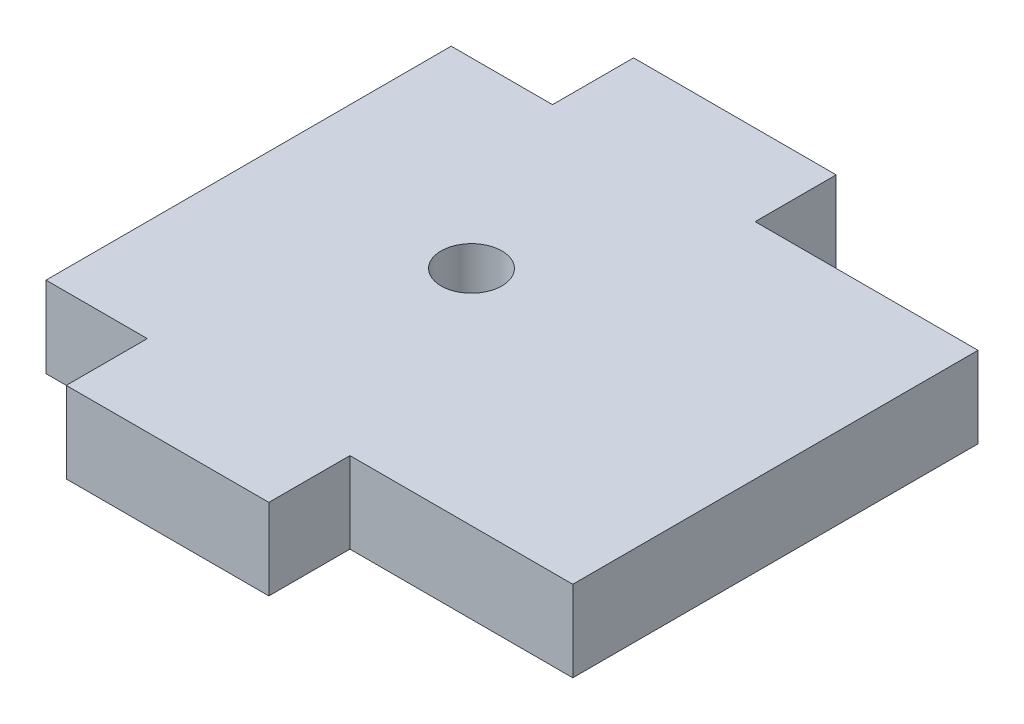
ISO-10303-21;
HEADER;
FILE_DESCRIPTION(('STEP AP214'),'2;1');
FILE_NAME('part.step','',(''),(''),'','','');
FILE_SCHEMA(('AUTOMOTIVE_DESIGN { 1 0 10303 214 1 1 1 1 }'));
ENDSEC;
DATA;
#1=APPLICATION_CONTEXT('core data for automotive mechanical design processes');
#2=APPLICATION_PROTOCOL_DEFINITION('international standard','automotive_design',2000,#1);
#3=PRODUCT_CONTEXT('',#1,'mechanical');
#4=PRODUCT('Part','Part','',(#3));
#5=PRODUCT_RELATED_PRODUCT_CATEGORY('part','',(#4));
#6=PRODUCT_DEFINITION_FORMATION('','',#4);
#7=PRODUCT_DEFINITION_CONTEXT('part definition',#1,'design');
#8=PRODUCT_DEFINITION('design','',#6,#7);
#9=PRODUCT_DEFINITION_SHAPE('','',#8);
#10=(LENGTH_UNIT() NAMED_UNIT(*) SI_UNIT(.MILLI.,.METRE.));
#11=(NAMED_UNIT(*) PLANE_ANGLE_UNIT() SI_UNIT($,.RADIAN.));
#12=(NAMED_UNIT(*) SI_UNIT($,.STERADIAN.) SOLID_ANGLE_UNIT());
#13=UNCERTAINTY_MEASURE_WITH_UNIT(LENGTH_MEASURE(1.E-05),#10,'distance_accuracy_value','');
#14=(GEOMETRIC_REPRESENTATION_CONTEXT(3) GLOBAL_UNCERTAINTY_ASSIGNED_CONTEXT((#13)) GLOBAL_UNIT_ASSIGNED_CONTEXT((#10,
#11,#12)) REPRESENTATION_CONTEXT('',''));
#15=CARTESIAN_POINT('',(0.,0.,0.));
#16=DIRECTION('',(0.,0.,1.));
#17=DIRECTION('',(1.,0.,0.));
#18=AXIS2_PLACEMENT_3D('',#15,#16,#17);
#19=CARTESIAN_POINT('',(0.,4.,0.));
#20=DIRECTION('',(0.,-1.,0.));
#21=DIRECTION('',(0.,0.,-1.));
#22=AXIS2_PLACEMENT_3D('',#19,#20,#21);
#23=PLANE('',#22);
#24=DIRECTION('',(0.,0.,1.));
#25=VECTOR('',#24,1.);
#26=CARTESIAN_POINT('',(0.,4.,0.));
#27=LINE('',#26,#25);
#28=CARTESIAN_POINT('',(0.,4.,-20.));
#29=VERTEX_POINT('',#28);
#30=CARTESIAN_POINT('',(0.,4.,0.));
#31=VERTEX_POINT('',#30);
#32=EDGE_CURVE('E206',#29,#31,#27,.T.);
#33=ORIENTED_EDGE('',*,*,#32,.T.);
#34=DIRECTION('',(1.,0.,0.));
#35=VECTOR('',#34,1.);
#36=CARTESIAN_POINT('',(0.,4.,0.));
#37=LINE('',#36,#35);
#38=CARTESIAN_POINT('',(5.,4.,0.));
#39=VERTEX_POINT('',#38);
#40=EDGE_CURVE('E118',#31,#39,#37,.T.);
#41=ORIENTED_EDGE('',*,*,#40,.T.);
#42=DIRECTION('',(0.,0.,1.));
#43=VECTOR('',#42,1.);
#44=CARTESIAN_POINT('',(5.,4.,0.));
#45=LINE('',#44,#43);
#46=CARTESIAN_POINT('',(5.,4.,4.));
#47=VERTEX_POINT('',#46);
#48=EDGE_CURVE('E243',#39,#47,#45,.T.);
#49=ORIENTED_EDGE('',*,*,#48,.T.);
#50=DIRECTION('',(1.,0.,0.));
#51=VECTOR('',#50,1.);
#52=CARTESIAN_POINT('',(5.,4.,4.));
#53=LINE('',#52,#51);
#54=CARTESIAN_POINT('',(15.,4.,4.));
#55=VERTEX_POINT('',#54);
#56=EDGE_CURVE('E263',#47,#55,#53,.T.);
#57=ORIENTED_EDGE('',*,*,#56,.T.);
#58=DIRECTION('',(0.,0.,-1.));
#59=VECTOR('',#58,1.);
#60=CARTESIAN_POINT('',(15.,4.,0.));
#61=LINE('',#60,#59);
#62=CARTESIAN_POINT('',(15.,4.,0.));
#63=VERTEX_POINT('',#62);
#64=EDGE_CURVE('E259',#55,#63,#61,.T.);
#65=ORIENTED_EDGE('',*,*,#64,.T.);
#66=DIRECTION('',(1.,0.,0.));
#67=VECTOR('',#66,1.);
#68=CARTESIAN_POINT('',(15.,4.,0.));
#69=LINE('',#68,#67);
#70=CARTESIAN_POINT('',(26.,4.,0.));
#71=VERTEX_POINT('',#70);
#72=EDGE_CURVE('E262',#63,#71,#69,.T.);
#73=ORIENTED_EDGE('',*,*,#72,.T.);
#74=DIRECTION('',(0.,0.,-1.));
#75=VECTOR('',#74,1.);
#76=CARTESIAN_POINT('',(26.,4.,0.));
#77=LINE('',#76,#75);
#78=CARTESIAN_POINT('',(26.,4.,-20.));
#79=VERTEX_POINT('',#78);
#80=EDGE_CURVE('E267',#71,#79,#77,.T.);
#81=ORIENTED_EDGE('',*,*,#80,.T.);
#82=DIRECTION('',(-1.,0.,0.));
#83=VECTOR('',#82,1.);
#84=CARTESIAN_POINT('',(15.,4.,-20.));
#85=LINE('',#84,#83);
#86=CARTESIAN_POINT('',(15.,4.,-20.));
#87=VERTEX_POINT('',#86);
#88=EDGE_CURVE('E274',#79,#87,#85,.T.);
#89=ORIENTED_EDGE('',*,*,#88,.T.);
#90=DIRECTION('',(0.,0.,-1.));
#91=VECTOR('',#90,1.);
#92=CARTESIAN_POINT('',(15.,4.,-20.));
#93=LINE('',#92,#91);
#94=CARTESIAN_POINT('',(15.,4.,-24.));
#95=VERTEX_POINT('',#94);
#96=EDGE_CURVE('E149',#87,#95,#93,.T.);
#97=ORIENTED_EDGE('',*,*,#96,.T.);
#98=DIRECTION('',(-1.,0.,0.));
#99=VECTOR('',#98,1.);
#100=CARTESIAN_POINT('',(5.,4.,-24.));
#101=LINE('',#100,#99);
#102=CARTESIAN_POINT('',(5.,4.,-24.));
#103=VERTEX_POINT('',#102);
#104=EDGE_CURVE('E143',#95,#103,#101,.T.);
#105=ORIENTED_EDGE('',*,*,#104,.T.);
#106=DIRECTION('',(0.,0.,1.));
#107=VECTOR('',#106,1.);
#108=CARTESIAN_POINT('',(5.,4.,-20.));
#109=LINE('',#108,#107);
#110=CARTESIAN_POINT('',(5.,4.,-20.));
#111=VERTEX_POINT('',#110);
#112=EDGE_CURVE('E147',#103,#111,#109,.T.);
#113=ORIENTED_EDGE('',*,*,#112,.T.);
#114=DIRECTION('',(-1.,0.,0.));
#115=VECTOR('',#114,1.);
#116=CARTESIAN_POINT('',(0.,4.,-20.));
#117=LINE('',#116,#115);
#118=EDGE_CURVE('E63',#111,#29,#117,.T.);
#119=ORIENTED_EDGE('',*,*,#118,.T.);
#120=EDGE_LOOP('',(#33,#41,#49,#57,#65,#73,#81,#89,#97,#105,#113,#119));
#121=FACE_BOUND('',#120,.T.);
#122=CARTESIAN_POINT('',(10.,4.,-11.));
#123=DIRECTION('',(0.,1.,0.));
#124=DIRECTION('',(0.,0.,1.));
#125=AXIS2_PLACEMENT_3D('',#122,#123,#124);
#126=CIRCLE('',#125,1.5);
#127=CARTESIAN_POINT('',(10.,4.,-9.5));
#128=VERTEX_POINT('',#127);
#129=EDGE_CURVE('E176',#128,#128,#126,.T.);
#130=ORIENTED_EDGE('',*,*,#129,.F.);
#131=EDGE_LOOP('',(#130));
#132=FACE_BOUND('',#131,.T.);
#133=ADVANCED_FACE('F45',(#121,#132),#23,.F.);
#134=CARTESIAN_POINT('',(0.,0.,0.));
#135=DIRECTION('',(0.,-1.,0.));
#136=DIRECTION('',(0.,0.,-1.));
#137=AXIS2_PLACEMENT_3D('',#134,#135,#136);
#138=PLANE('',#137);
#139=DIRECTION('',(0.,0.,1.));
#140=VECTOR('',#139,1.);
#141=CARTESIAN_POINT('',(0.,0.,0.));
#142=LINE('',#141,#140);
#143=CARTESIAN_POINT('',(0.,0.,-20.));
#144=VERTEX_POINT('',#143);
#145=CARTESIAN_POINT('',(0.,0.,0.));
#146=VERTEX_POINT('',#145);
#147=EDGE_CURVE('E171',#144,#146,#142,.T.);
#148=ORIENTED_EDGE('',*,*,#147,.F.);
#149=DIRECTION('',(-1.,0.,0.));
#150=VECTOR('',#149,1.);
#151=CARTESIAN_POINT('',(0.,0.,-20.));
#152=LINE('',#151,#150);
#153=CARTESIAN_POINT('',(5.,0.,-20.));
#154=VERTEX_POINT('',#153);
#155=EDGE_CURVE('E110',#154,#144,#152,.T.);
#156=ORIENTED_EDGE('',*,*,#155,.F.);
#157=DIRECTION('',(0.,0.,1.));
#158=VECTOR('',#157,1.);
#159=CARTESIAN_POINT('',(5.,0.,-20.));
#160=LINE('',#159,#158);
#161=CARTESIAN_POINT('',(5.,0.,-24.));
#162=VERTEX_POINT('',#161);
#163=EDGE_CURVE('E104',#162,#154,#160,.T.);
#164=ORIENTED_EDGE('',*,*,#163,.F.);
#165=DIRECTION('',(-1.,0.,0.));
#166=VECTOR('',#165,1.);
#167=CARTESIAN_POINT('',(5.,0.,-24.));
#168=LINE('',#167,#166);
#169=CARTESIAN_POINT('',(15.,0.,-24.));
#170=VERTEX_POINT('',#169);
#171=EDGE_CURVE('E158',#170,#162,#168,.T.);
#172=ORIENTED_EDGE('',*,*,#171,.F.);
#173=DIRECTION('',(0.,0.,-1.));
#174=VECTOR('',#173,1.);
#175=CARTESIAN_POINT('',(15.,0.,-20.));
#176=LINE('',#175,#174);
#177=CARTESIAN_POINT('',(15.,0.,-20.));
#178=VERTEX_POINT('',#177);
#179=EDGE_CURVE('E197',#178,#170,#176,.T.);
#180=ORIENTED_EDGE('',*,*,#179,.F.);
#181=DIRECTION('',(-1.,0.,0.));
#182=VECTOR('',#181,1.);
#183=CARTESIAN_POINT('',(15.,0.,-20.));
#184=LINE('',#183,#182);
#185=CARTESIAN_POINT('',(26.,0.,-20.));
#186=VERTEX_POINT('',#185);
#187=EDGE_CURVE('E194',#186,#178,#184,.T.);
#188=ORIENTED_EDGE('',*,*,#187,.F.);
#189=DIRECTION('',(0.,0.,-1.));
#190=VECTOR('',#189,1.);
#191=CARTESIAN_POINT('',(26.,0.,0.));
#192=LINE('',#191,#190);
#193=CARTESIAN_POINT('',(26.,0.,0.));
#194=VERTEX_POINT('',#193);
#195=EDGE_CURVE('E191',#194,#186,#192,.T.);
#196=ORIENTED_EDGE('',*,*,#195,.F.);
#197=DIRECTION('',(1.,0.,0.));
#198=VECTOR('',#197,1.);
#199=CARTESIAN_POINT('',(15.,0.,0.));
#200=LINE('',#199,#198);
#201=CARTESIAN_POINT('',(15.,0.,0.));
#202=VERTEX_POINT('',#201);
#203=EDGE_CURVE('E188',#202,#194,#200,.T.);
#204=ORIENTED_EDGE('',*,*,#203,.F.);
#205=DIRECTION('',(0.,0.,-1.));
#206=VECTOR('',#205,1.);
#207=CARTESIAN_POINT('',(15.,0.,0.));
#208=LINE('',#207,#206);
#209=CARTESIAN_POINT('',(15.,0.,4.));
#210=VERTEX_POINT('',#209);
#211=EDGE_CURVE('E185',#210,#202,#208,.T.);
#212=ORIENTED_EDGE('',*,*,#211,.F.);
#213=DIRECTION('',(1.,0.,0.));
#214=VECTOR('',#213,1.);
#215=CARTESIAN_POINT('',(5.,0.,4.));
#216=LINE('',#215,#214);
#217=CARTESIAN_POINT('',(5.,0.,4.));
#218=VERTEX_POINT('',#217);
#219=EDGE_CURVE('E182',#218,#210,#216,.T.);
#220=ORIENTED_EDGE('',*,*,#219,.F.);
#221=DIRECTION('',(0.,0.,1.));
#222=VECTOR('',#221,1.);
#223=CARTESIAN_POINT('',(5.,0.,0.));
#224=LINE('',#223,#222);
#225=CARTESIAN_POINT('',(5.,0.,0.));
#226=VERTEX_POINT('',#225);
#227=EDGE_CURVE('E179',#226,#218,#224,.T.);
#228=ORIENTED_EDGE('',*,*,#227,.F.);
#229=DIRECTION('',(1.,0.,0.));
#230=VECTOR('',#229,1.);
#231=CARTESIAN_POINT('',(0.,0.,0.));
#232=LINE('',#231,#230);
#233=EDGE_CURVE('E175',#146,#226,#232,.T.);
#234=ORIENTED_EDGE('',*,*,#233,.F.);
#235=EDGE_LOOP('',(#148,#156,#164,#172,#180,#188,#196,#204,#212,#220,#228,#234));
#236=FACE_BOUND('',#235,.T.);
#237=CARTESIAN_POINT('',(10.,0.,-11.));
#238=DIRECTION('',(0.,1.,0.));
#239=DIRECTION('',(0.,0.,1.));
#240=AXIS2_PLACEMENT_3D('',#237,#238,#239);
#241=CIRCLE('',#240,1.5);
#242=CARTESIAN_POINT('',(10.,0.,-9.5));
#243=VERTEX_POINT('',#242);
#244=EDGE_CURVE('E483',#243,#243,#241,.T.);
#245=ORIENTED_EDGE('',*,*,#244,.T.);
#246=EDGE_LOOP('',(#245));
#247=FACE_BOUND('',#246,.T.);
#248=ADVANCED_FACE('F247',(#236,#247),#138,.T.);
#249=CARTESIAN_POINT('',(0.,4.,0.));
#250=DIRECTION('',(1.,0.,0.));
#251=DIRECTION('',(0.,0.,-1.));
#252=AXIS2_PLACEMENT_3D('',#249,#250,#251);
#253=PLANE('',#252);
#254=ORIENTED_EDGE('',*,*,#147,.T.);
#255=DIRECTION('',(0.,-1.,0.));
#256=VECTOR('',#255,1.);
#257=CARTESIAN_POINT('',(0.,4.,0.));
#258=LINE('',#257,#256);
#259=EDGE_CURVE('E11',#31,#146,#258,.T.);
#260=ORIENTED_EDGE('',*,*,#259,.F.);
#261=ORIENTED_EDGE('',*,*,#32,.F.);
#262=DIRECTION('',(0.,-1.,0.));
#263=VECTOR('',#262,1.);
#264=CARTESIAN_POINT('',(0.,4.,-20.));
#265=LINE('',#264,#263);
#266=EDGE_CURVE('E167',#29,#144,#265,.T.);
#267=ORIENTED_EDGE('',*,*,#266,.T.);
#268=EDGE_LOOP('',(#254,#260,#261,#267));
#269=FACE_BOUND('',#268,.T.);
#270=ADVANCED_FACE('F47',(#269),#253,.F.);
#271=CARTESIAN_POINT('',(0.,4.,0.));
#272=DIRECTION('',(0.,0.,-1.));
#273=DIRECTION('',(-1.,0.,0.));
#274=AXIS2_PLACEMENT_3D('',#271,#272,#273);
#275=PLANE('',#274);
#276=ORIENTED_EDGE('',*,*,#233,.T.);
#277=DIRECTION('',(0.,-1.,0.));
#278=VECTOR('',#277,1.);
#279=CARTESIAN_POINT('',(5.,4.,0.));
#280=LINE('',#279,#278);
#281=EDGE_CURVE('E55',#39,#226,#280,.T.);
#282=ORIENTED_EDGE('',*,*,#281,.F.);
#283=ORIENTED_EDGE('',*,*,#40,.F.);
#284=ORIENTED_EDGE('',*,*,#259,.T.);
#285=EDGE_LOOP('',(#276,#282,#283,#284));
#286=FACE_BOUND('',#285,.T.);
#287=ADVANCED_FACE('F310',(#286),#275,.F.);
#288=CARTESIAN_POINT('',(5.,4.,0.));
#289=DIRECTION('',(1.,0.,0.));
#290=DIRECTION('',(0.,0.,-1.));
#291=AXIS2_PLACEMENT_3D('',#288,#289,#290);
#292=PLANE('',#291);
#293=ORIENTED_EDGE('',*,*,#227,.T.);
#294=DIRECTION('',(0.,-1.,0.));
#295=VECTOR('',#294,1.);
#296=CARTESIAN_POINT('',(5.,4.,4.));
#297=LINE('',#296,#295);
#298=EDGE_CURVE('E233',#47,#218,#297,.T.);
#299=ORIENTED_EDGE('',*,*,#298,.F.);
#300=ORIENTED_EDGE('',*,*,#48,.F.);
#301=ORIENTED_EDGE('',*,*,#281,.T.);
#302=EDGE_LOOP('',(#293,#299,#300,#301));
#303=FACE_BOUND('',#302,.T.);
#304=ADVANCED_FACE('F241',(#303),#292,.F.);
#305=CARTESIAN_POINT('',(5.,4.,4.));
#306=DIRECTION('',(0.,0.,-1.));
#307=DIRECTION('',(-1.,0.,0.));
#308=AXIS2_PLACEMENT_3D('',#305,#306,#307);
#309=PLANE('',#308);
#310=ORIENTED_EDGE('',*,*,#219,.T.);
#311=DIRECTION('',(0.,-1.,0.));
#312=VECTOR('',#311,1.);
#313=CARTESIAN_POINT('',(15.,4.,4.));
#314=LINE('',#313,#312);
#315=EDGE_CURVE('E229',#55,#210,#314,.T.);
#316=ORIENTED_EDGE('',*,*,#315,.F.);
#317=ORIENTED_EDGE('',*,*,#56,.F.);
#318=ORIENTED_EDGE('',*,*,#298,.T.);
#319=EDGE_LOOP('',(#310,#316,#317,#318));
#320=FACE_BOUND('',#319,.T.);
#321=ADVANCED_FACE('F253',(#320),#309,.F.);
#322=CARTESIAN_POINT('',(15.,4.,0.));
#323=DIRECTION('',(-1.,0.,0.));
#324=DIRECTION('',(0.,0.,1.));
#325=AXIS2_PLACEMENT_3D('',#322,#323,#324);
#326=PLANE('',#325);
#327=ORIENTED_EDGE('',*,*,#211,.T.);
#328=DIRECTION('',(0.,-1.,0.));
#329=VECTOR('',#328,1.);
#330=CARTESIAN_POINT('',(15.,4.,0.));
#331=LINE('',#330,#329);
#332=EDGE_CURVE('E225',#63,#202,#331,.T.);
#333=ORIENTED_EDGE('',*,*,#332,.F.);
#334=ORIENTED_EDGE('',*,*,#64,.F.);
#335=ORIENTED_EDGE('',*,*,#315,.T.);
#336=EDGE_LOOP('',(#327,#333,#334,#335));
#337=FACE_BOUND('',#336,.T.);
#338=ADVANCED_FACE('F257',(#337),#326,.F.);
#339=CARTESIAN_POINT('',(15.,4.,0.));
#340=DIRECTION('',(0.,0.,-1.));
#341=DIRECTION('',(-1.,0.,0.));
#342=AXIS2_PLACEMENT_3D('',#339,#340,#341);
#343=PLANE('',#342);
#344=ORIENTED_EDGE('',*,*,#203,.T.);
#345=DIRECTION('',(0.,-1.,0.));
#346=VECTOR('',#345,1.);
#347=CARTESIAN_POINT('',(26.,4.,0.));
#348=LINE('',#347,#346);
#349=EDGE_CURVE('E221',#71,#194,#348,.T.);
#350=ORIENTED_EDGE('',*,*,#349,.F.);
#351=ORIENTED_EDGE('',*,*,#72,.F.);
#352=ORIENTED_EDGE('',*,*,#332,.T.);
#353=EDGE_LOOP('',(#344,#350,#351,#352));
#354=FACE_BOUND('',#353,.T.);
#355=ADVANCED_FACE('F323',(#354),#343,.F.);
#356=CARTESIAN_POINT('',(26.,4.,0.));
#357=DIRECTION('',(-1.,0.,0.));
#358=DIRECTION('',(0.,0.,1.));
#359=AXIS2_PLACEMENT_3D('',#356,#357,#358);
#360=PLANE('',#359);
#361=ORIENTED_EDGE('',*,*,#195,.T.);
#362=DIRECTION('',(0.,-1.,0.));
#363=VECTOR('',#362,1.);
#364=CARTESIAN_POINT('',(26.,4.,-20.));
#365=LINE('',#364,#363);
#366=EDGE_CURVE('E217',#79,#186,#365,.T.);
#367=ORIENTED_EDGE('',*,*,#366,.F.);
#368=ORIENTED_EDGE('',*,*,#80,.F.);
#369=ORIENTED_EDGE('',*,*,#349,.T.);
#370=EDGE_LOOP('',(#361,#367,#368,#369));
#371=FACE_BOUND('',#370,.T.);
#372=ADVANCED_FACE('F326',(#371),#360,.F.);
#373=CARTESIAN_POINT('',(15.,4.,-20.));
#374=DIRECTION('',(0.,0.,1.));
#375=DIRECTION('',(1.,0.,0.));
#376=AXIS2_PLACEMENT_3D('',#373,#374,#375);
#377=PLANE('',#376);
#378=ORIENTED_EDGE('',*,*,#187,.T.);
#379=DIRECTION('',(0.,-1.,0.));
#380=VECTOR('',#379,1.);
#381=CARTESIAN_POINT('',(15.,4.,-20.));
#382=LINE('',#381,#380);
#383=EDGE_CURVE('E213',#87,#178,#382,.T.);
#384=ORIENTED_EDGE('',*,*,#383,.F.);
#385=ORIENTED_EDGE('',*,*,#88,.F.);
#386=ORIENTED_EDGE('',*,*,#366,.T.);
#387=EDGE_LOOP('',(#378,#384,#385,#386));
#388=FACE_BOUND('',#387,.T.);
#389=ADVANCED_FACE('F282',(#388),#377,.F.);
#390=CARTESIAN_POINT('',(15.,4.,-20.));
#391=DIRECTION('',(-1.,0.,0.));
#392=DIRECTION('',(0.,0.,1.));
#393=AXIS2_PLACEMENT_3D('',#390,#391,#392);
#394=PLANE('',#393);
#395=ORIENTED_EDGE('',*,*,#179,.T.);
#396=DIRECTION('',(0.,-1.,0.));
#397=VECTOR('',#396,1.);
#398=CARTESIAN_POINT('',(15.,4.,-24.));
#399=LINE('',#398,#397);
#400=EDGE_CURVE('E160',#95,#170,#399,.T.);
#401=ORIENTED_EDGE('',*,*,#400,.F.);
#402=ORIENTED_EDGE('',*,*,#96,.F.);
#403=ORIENTED_EDGE('',*,*,#383,.T.);
#404=EDGE_LOOP('',(#395,#401,#402,#403));
#405=FACE_BOUND('',#404,.T.);
#406=ADVANCED_FACE('F286',(#405),#394,.F.);
#407=CARTESIAN_POINT('',(5.,4.,-24.));
#408=DIRECTION('',(0.,0.,1.));
#409=DIRECTION('',(1.,0.,0.));
#410=AXIS2_PLACEMENT_3D('',#407,#408,#409);
#411=PLANE('',#410);
#412=ORIENTED_EDGE('',*,*,#171,.T.);
#413=DIRECTION('',(0.,-1.,0.));
#414=VECTOR('',#413,1.);
#415=CARTESIAN_POINT('',(5.,4.,-24.));
#416=LINE('',#415,#414);
#417=EDGE_CURVE('E155',#103,#162,#416,.T.);
#418=ORIENTED_EDGE('',*,*,#417,.F.);
#419=ORIENTED_EDGE('',*,*,#104,.F.);
#420=ORIENTED_EDGE('',*,*,#400,.T.);
#421=EDGE_LOOP('',(#412,#418,#419,#420));
#422=FACE_BOUND('',#421,.T.);
#423=ADVANCED_FACE('F156',(#422),#411,.F.);
#424=CARTESIAN_POINT('',(5.,4.,-20.));
#425=DIRECTION('',(1.,0.,0.));
#426=DIRECTION('',(0.,0.,-1.));
#427=AXIS2_PLACEMENT_3D('',#424,#425,#426);
#428=PLANE('',#427);
#429=ORIENTED_EDGE('',*,*,#163,.T.);
#430=DIRECTION('',(0.,-1.,0.));
#431=VECTOR('',#430,1.);
#432=CARTESIAN_POINT('',(5.,4.,-20.));
#433=LINE('',#432,#431);
#434=EDGE_CURVE('E161',#111,#154,#433,.T.);
#435=ORIENTED_EDGE('',*,*,#434,.F.);
#436=ORIENTED_EDGE('',*,*,#112,.F.);
#437=ORIENTED_EDGE('',*,*,#417,.T.);
#438=EDGE_LOOP('',(#429,#435,#436,#437));
#439=FACE_BOUND('',#438,.T.);
#440=ADVANCED_FACE('F163',(#439),#428,.F.);
#441=CARTESIAN_POINT('',(0.,4.,-20.));
#442=DIRECTION('',(0.,0.,1.));
#443=DIRECTION('',(1.,0.,0.));
#444=AXIS2_PLACEMENT_3D('',#441,#442,#443);
#445=PLANE('',#444);
#446=ORIENTED_EDGE('',*,*,#155,.T.);
#447=ORIENTED_EDGE('',*,*,#266,.F.);
#448=ORIENTED_EDGE('',*,*,#118,.F.);
#449=ORIENTED_EDGE('',*,*,#434,.T.);
#450=EDGE_LOOP('',(#446,#447,#448,#449));
#451=FACE_BOUND('',#450,.T.);
#452=ADVANCED_FACE('F290',(#451),#445,.F.);
#453=CARTESIAN_POINT('',(10.,4.,-11.));
#454=DIRECTION('',(0.,-1.,0.));
#455=DIRECTION('',(0.,0.,-1.));
#456=AXIS2_PLACEMENT_3D('',#453,#454,#455);
#457=CYLINDRICAL_SURFACE('',#456,1.5);
#458=ORIENTED_EDGE('',*,*,#129,.T.);
#459=EDGE_LOOP('',(#458));
#460=FACE_BOUND('',#459,.T.);
#461=ORIENTED_EDGE('',*,*,#244,.F.);
#462=EDGE_LOOP('',(#461));
#463=FACE_BOUND('',#462,.T.);
#464=ADVANCED_FACE('F292',(#460,#463),#457,.F.);
#465=CLOSED_SHELL('',(#133,#248,#270,#287,#304,#321,#338,#355,#372,#389,#406,#423,#440,#452,#464));
#466=MANIFOLD_SOLID_BREP('B2',#465);
#467=ADVANCED_BREP_SHAPE_REPRESENTATION('',(#18,#466),#14);
#468=SHAPE_DEFINITION_REPRESENTATION(#9,#467);
ENDSEC;
END-ISO-10303-21;
